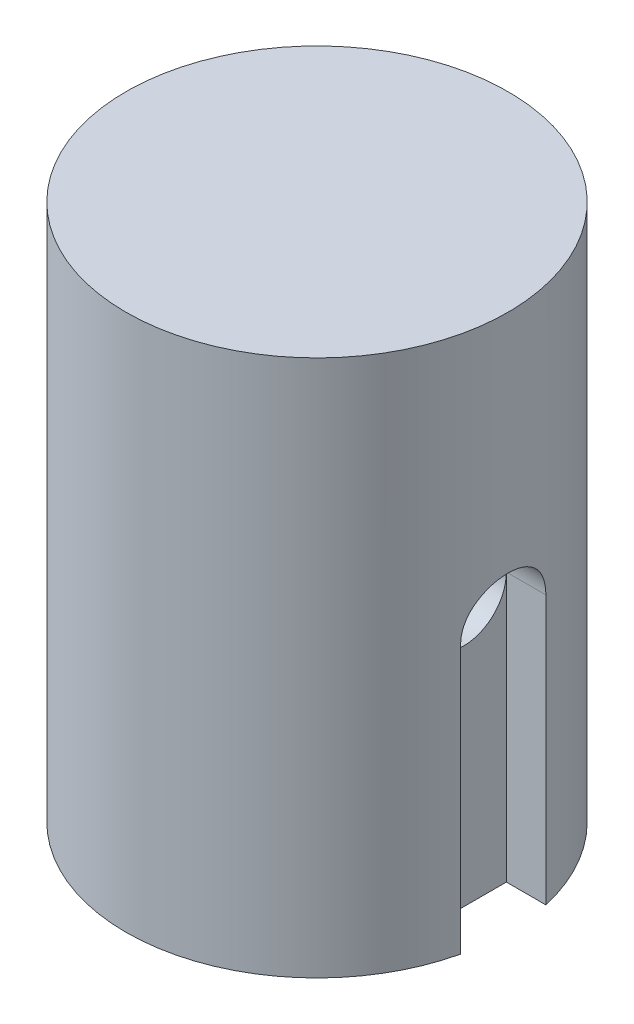
ISO-10303-21;
HEADER;
FILE_DESCRIPTION(('STEP AP214'),'2;1');
FILE_NAME('part.step','',(''),(''),'','','');
FILE_SCHEMA(('AUTOMOTIVE_DESIGN { 1 0 10303 214 1 1 1 1 }'));
ENDSEC;
DATA;
#1=APPLICATION_CONTEXT('core data for automotive mechanical design processes');
#2=APPLICATION_PROTOCOL_DEFINITION('international standard','automotive_design',2000,#1);
#3=PRODUCT_CONTEXT('',#1,'mechanical');
#4=PRODUCT('Part','Part','',(#3));
#5=PRODUCT_RELATED_PRODUCT_CATEGORY('part','',(#4));
#6=PRODUCT_DEFINITION_FORMATION('','',#4);
#7=PRODUCT_DEFINITION_CONTEXT('part definition',#1,'design');
#8=PRODUCT_DEFINITION('design','',#6,#7);
#9=PRODUCT_DEFINITION_SHAPE('','',#8);
#10=(LENGTH_UNIT() NAMED_UNIT(*) SI_UNIT(.MILLI.,.METRE.));
#11=(NAMED_UNIT(*) PLANE_ANGLE_UNIT() SI_UNIT($,.RADIAN.));
#12=(NAMED_UNIT(*) SI_UNIT($,.STERADIAN.) SOLID_ANGLE_UNIT());
#13=UNCERTAINTY_MEASURE_WITH_UNIT(LENGTH_MEASURE(1.E-05),#10,'distance_accuracy_value','');
#14=(GEOMETRIC_REPRESENTATION_CONTEXT(3) GLOBAL_UNCERTAINTY_ASSIGNED_CONTEXT((#13)) GLOBAL_UNIT_ASSIGNED_CONTEXT((#10,
#11,#12)) REPRESENTATION_CONTEXT('',''));
#15=CARTESIAN_POINT('',(0.,0.,0.));
#16=DIRECTION('',(0.,0.,1.));
#17=DIRECTION('',(1.,0.,0.));
#18=AXIS2_PLACEMENT_3D('',#15,#16,#17);
#19=CARTESIAN_POINT('',(0.,-25.,0.));
#20=DIRECTION('',(0.,1.,0.));
#21=DIRECTION('',(0.,0.,1.));
#22=AXIS2_PLACEMENT_3D('',#19,#20,#21);
#23=CYLINDRICAL_SURFACE('',#22,8.895);
#24=DIRECTION('',(0.,-1.,0.));
#25=VECTOR('',#24,1.);
#26=CARTESIAN_POINT('',(-8.67082930632215,-12.5,-1.98437499999999));
#27=LINE('',#26,#25);
#28=CARTESIAN_POINT('',(-8.67082930632215,-12.5,-1.984375));
#29=VERTEX_POINT('',#28);
#30=CARTESIAN_POINT('',(-8.67082930632215,-25.,-1.98437499999999));
#31=VERTEX_POINT('',#30);
#32=EDGE_CURVE('E146',#29,#31,#27,.T.);
#33=ORIENTED_EDGE('',*,*,#32,.F.);
#34=CARTESIAN_POINT('',(-8.895,-10.515625,0.));
#35=CARTESIAN_POINT('',(-8.89499798053136,-10.5156286782961,-0.110003108531044));
#36=CARTESIAN_POINT('',(-8.89293872905295,-10.5248028437771,-0.220050190385659));
#37=CARTESIAN_POINT('',(-8.88492294410009,-10.5612168017032,-0.437014773196951));
#38=CARTESIAN_POINT('',(-8.87896370197709,-10.5884691501126,-0.543930045069365));
#39=CARTESIAN_POINT('',(-8.86381097564101,-10.66014046251,-0.751464389222808));
#40=CARTESIAN_POINT('',(-8.85462093856362,-10.7045411348459,-0.852090038043748));
#41=CARTESIAN_POINT('',(-8.83399673910637,-10.809189812261,-1.04446068714721));
#42=CARTESIAN_POINT('',(-8.82256261666939,-10.8694375352822,-1.13620584545178));
#43=CARTESIAN_POINT('',(-8.79848845487047,-11.0051316026497,-1.30974205494041));
#44=CARTESIAN_POINT('',(-8.78583296110134,-11.0807914141361,-1.39136405863448));
#45=CARTESIAN_POINT('',(-8.76085045969245,-11.2447038420026,-1.54087074401027));
#46=CARTESIAN_POINT('',(-8.74852348238285,-11.332957616368,-1.60875416107165));
#47=CARTESIAN_POINT('',(-8.72544092397066,-11.520810939859,-1.72960902031442));
#48=CARTESIAN_POINT('',(-8.71470512331446,-11.6205296910602,-1.78239929438126));
#49=CARTESIAN_POINT('',(-8.69624278881732,-11.8277023668504,-1.87040686218199));
#50=CARTESIAN_POINT('',(-8.68851587956583,-11.9351553244818,-1.90562634832583));
#51=CARTESIAN_POINT('',(-8.67710379688232,-12.1529089981679,-1.95693151039241));
#52=CARTESIAN_POINT('',(-8.67335534128796,-12.2631356576469,-1.9733171227466));
#53=CARTESIAN_POINT('',(-8.67013460913494,-12.4848322544565,-1.98742225140913));
#54=CARTESIAN_POINT('',(-8.67066178498573,-12.5963020307519,-1.98514415802333));
#55=CARTESIAN_POINT('',(-8.6758755128654,-12.8150819521088,-1.96222763913715));
#56=CARTESIAN_POINT('',(-8.68048286491296,-12.9224308899092,-1.94193880078754));
#57=CARTESIAN_POINT('',(-8.69321246305035,-13.1321618701326,-1.88413107223078));
#58=CARTESIAN_POINT('',(-8.70133491344556,-13.2345436234669,-1.84661118050843));
#59=CARTESIAN_POINT('',(-8.72025684575896,-13.4324107413625,-1.75508849250558));
#60=CARTESIAN_POINT('',(-8.73107785800529,-13.5278322502844,-1.70095228060515));
#61=CARTESIAN_POINT('',(-8.75416459631689,-13.7083654708171,-1.57782741855743));
#62=CARTESIAN_POINT('',(-8.76643052669428,-13.7934757209513,-1.50883666682662));
#63=CARTESIAN_POINT('',(-8.79136402902234,-13.9529819654673,-1.35611581093398));
#64=CARTESIAN_POINT('',(-8.8040344247618,-14.0270934621295,-1.27208872607875));
#65=CARTESIAN_POINT('',(-8.82809796612522,-14.1602203300518,-1.09265382918496));
#66=CARTESIAN_POINT('',(-8.83949108676558,-14.2192354060537,-0.99724579460952));
#67=CARTESIAN_POINT('',(-8.85975573704167,-14.3205689320845,-0.797402322384055));
#68=CARTESIAN_POINT('',(-8.86862144653922,-14.3628489299928,-0.692946759215006));
#69=CARTESIAN_POINT('',(-8.88278925247284,-14.4291766978656,-0.478171595830713));
#70=CARTESIAN_POINT('',(-8.88809188846723,-14.4532272283998,-0.367852886206666));
#71=CARTESIAN_POINT('',(-8.89445888054048,-14.4819968395156,-0.146922244637292));
#72=CARTESIAN_POINT('',(-8.89560839126927,-14.487104381303,-0.0363632839080309));
#73=CARTESIAN_POINT('',(-8.89377875578923,-14.4788975892449,0.184028216567811));
#74=CARTESIAN_POINT('',(-8.8907999015053,-14.4655845579548,0.293860807125686));
#75=CARTESIAN_POINT('',(-8.88110209755264,-14.4212364374193,0.508386435136476));
#76=CARTESIAN_POINT('',(-8.87442639805636,-14.3904061793644,0.613123945630332));
#77=CARTESIAN_POINT('',(-8.85808259752387,-14.3121269856043,0.815940337496674));
#78=CARTESIAN_POINT('',(-8.84841423460527,-14.2646765954544,0.914018635217614));
#79=CARTESIAN_POINT('',(-8.82694819211914,-14.1537022358176,1.10233086452755));
#80=CARTESIAN_POINT('',(-8.81512120261388,-14.0899514567944,1.1924277186746));
#81=CARTESIAN_POINT('',(-8.79070766484064,-13.9484834474263,1.36078396392382));
#82=CARTESIAN_POINT('',(-8.77812101382286,-13.8707643249358,1.43904174866253));
#83=CARTESIAN_POINT('',(-8.75331093693519,-13.7017800928848,1.58304298834678));
#84=CARTESIAN_POINT('',(-8.74109914583823,-13.6102832900571,1.64851693602485));
#85=CARTESIAN_POINT('',(-8.71869698047453,-13.4173649355546,1.76317168339184));
#86=CARTESIAN_POINT('',(-8.70850651768816,-13.315943818784,1.81235319663538));
#87=CARTESIAN_POINT('',(-8.69140054463049,-13.1066041991113,1.89268852324433));
#88=CARTESIAN_POINT('',(-8.68446640876592,-12.9987267288714,1.92394509722755));
#89=CARTESIAN_POINT('',(-8.67462629679212,-12.7790753551192,1.96784118701104));
#90=CARTESIAN_POINT('',(-8.67171964652347,-12.6673021069317,1.98048381861487));
#91=CARTESIAN_POINT('',(-8.67030729710035,-12.4457524437848,1.9866564116767));
#92=CARTESIAN_POINT('',(-8.67170310734381,-12.3359883589578,1.98061409297813));
#93=CARTESIAN_POINT('',(-8.67851500496339,-12.1190849742809,1.95054750257742));
#94=CARTESIAN_POINT('',(-8.68393104095299,-12.0119456408994,1.92652346071756));
#95=CARTESIAN_POINT('',(-8.6981241844418,-11.8036893505729,1.86138575645093));
#96=CARTESIAN_POINT('',(-8.70688857054173,-11.7025512531436,1.82033672721598));
#97=CARTESIAN_POINT('',(-8.72679539432478,-11.5085347915276,1.72236893705458));
#98=CARTESIAN_POINT('',(-8.73793809113817,-11.4156573289467,1.66544844663638));
#99=CARTESIAN_POINT('',(-8.76163848646004,-11.238695474782,1.53594515186167));
#100=CARTESIAN_POINT('',(-8.77422098481682,-11.154836679788,1.46305855847869));
#101=CARTESIAN_POINT('',(-8.79921922589108,-11.0004001651611,1.30430465490752));
#102=CARTESIAN_POINT('',(-8.81163492929224,-10.9298255275292,1.21843434073407));
#103=CARTESIAN_POINT('',(-8.83510136371243,-10.8030382120514,1.03474108869537));
#104=CARTESIAN_POINT('',(-8.84613120897754,-10.7470341562857,0.936771332481138));
#105=CARTESIAN_POINT('',(-8.86537241774909,-10.6523773860926,0.732581640881906));
#106=CARTESIAN_POINT('',(-8.87358609932992,-10.6137103928671,0.626368579579056));
#107=CARTESIAN_POINT('',(-8.88483654653533,-10.5615673365609,0.43340420838887));
#108=CARTESIAN_POINT('',(-8.88862390497389,-10.5443723842688,0.347682052709739));
#109=CARTESIAN_POINT('',(-8.8937063738634,-10.5214000285145,0.174649120553264));
#110=CARTESIAN_POINT('',(-8.89500160338379,-10.5156220795683,0.0873384201749424));
#111=CARTESIAN_POINT('',(-8.895,-10.515625,0.));
#112=B_SPLINE_CURVE_WITH_KNOTS('',3,(#34,#35,#36,#37,#38,#39,#40,#41,#42,#43,#44,#45,#46,#47,
#48,#49,#50,#51,#52,#53,#54,#55,#56,#57,#58,#59,#60,#61,#62,#63,#64,#65,#66,#67,#68,#69,#70,#71,
#72,#73,#74,#75,#76,#77,#78,#79,#80,#81,#82,#83,#84,#85,#86,#87,#88,#89,#90,#91,#92,#93,#94,#95,
#96,#97,#98,#99,#100,#101,#102,#103,#104,#105,#106,#107,#108,#109,#110,#111),.UNSPECIFIED.,.T.,
.F.,(4,2,2,2,2,2,2,2,2,2,2,2,2,2,2,2,2,2,2,2,2,2,2,2,2,2,2,2,2,2,2,2,2,2,2,2,2,2,4),(0.,
0.32968958471569,0.659608391077071,0.989176249620352,1.31873824265806,1.65322013476703,
1.98773280154188,2.32610663322488,2.6644382334597,2.99730368340978,3.33012650314447,
3.65662716066737,3.98314679768962,4.31235992028412,4.64161964977686,4.97829541698964,
5.31497776845579,5.65242928429447,5.98982968812842,6.32027155964406,6.65069006614927,
6.9773221968005,7.30398291850589,7.63546294699817,7.96698791151875,8.30488633992517,
8.64276996754305,8.97869668766252,9.31456717032856,9.64280656540119,9.97104176499135,
10.2980421054524,10.6250780926347,10.9589814011184,11.2929620818613,11.631489944489,
11.9697384812382,12.2315123866697,12.493273784704),.UNSPECIFIED.);
#113=CARTESIAN_POINT('',(-8.67082930632215,-12.5,1.984375));
#114=VERTEX_POINT('',#113);
#115=EDGE_CURVE('E174',#114,#29,#112,.T.);
#116=ORIENTED_EDGE('',*,*,#115,.F.);
#117=DIRECTION('',(0.,-1.,0.));
#118=VECTOR('',#117,1.);
#119=CARTESIAN_POINT('',(-8.67082930632215,-12.5,1.984375));
#120=LINE('',#119,#118);
#121=CARTESIAN_POINT('',(-8.67082930632215,-25.,1.984375));
#122=VERTEX_POINT('',#121);
#123=EDGE_CURVE('E148',#114,#122,#120,.T.);
#124=ORIENTED_EDGE('',*,*,#123,.T.);
#125=CARTESIAN_POINT('',(0.,-25.,0.));
#126=DIRECTION('',(0.,1.,0.));
#127=DIRECTION('',(0.,0.,1.));
#128=AXIS2_PLACEMENT_3D('',#125,#126,#127);
#129=CIRCLE('',#128,8.895);
#130=CARTESIAN_POINT('',(8.67082930632215,-25.,1.984375));
#131=VERTEX_POINT('',#130);
#132=EDGE_CURVE('E11',#122,#131,#129,.T.);
#133=ORIENTED_EDGE('',*,*,#132,.T.);
#134=DIRECTION('',(0.,-1.,0.));
#135=VECTOR('',#134,1.);
#136=CARTESIAN_POINT('',(8.67082930632215,-12.5,1.984375));
#137=LINE('',#136,#135);
#138=CARTESIAN_POINT('',(8.67082930632215,-12.5,1.984375));
#139=VERTEX_POINT('',#138);
#140=EDGE_CURVE('E55',#139,#131,#137,.T.);
#141=ORIENTED_EDGE('',*,*,#140,.F.);
#142=CARTESIAN_POINT('',(8.67082930632215,-12.5,-1.984375));
#143=CARTESIAN_POINT('',(8.67083152693427,-12.3900352924012,-1.98437129476868));
#144=CARTESIAN_POINT('',(8.67294398159313,-12.2800265459929,-1.97520331559507));
#145=CARTESIAN_POINT('',(8.68114924080244,-12.0631415333078,-1.9388161542682));
#146=CARTESIAN_POINT('',(8.687244848201,-11.956267528248,-1.91158426077147));
#147=CARTESIAN_POINT('',(8.70269247518692,-11.748820633369,-1.83997273746253));
#148=CARTESIAN_POINT('',(8.71204083806803,-11.6482408168817,-1.79561235715901));
#149=CARTESIAN_POINT('',(8.73293623267991,-11.4559475998378,-1.69105869172377));
#150=CARTESIAN_POINT('',(8.74448323779282,-11.3642340919615,-1.63086559826731));
#151=CARTESIAN_POINT('',(8.76870152698746,-11.190664815864,-1.49522783567887));
#152=CARTESIAN_POINT('',(8.78138768085908,-11.1089875068265,-1.41955741552215));
#153=CARTESIAN_POINT('',(8.80632483899608,-10.959373320034,-1.25560020996667));
#154=CARTESIAN_POINT('',(8.81857580851969,-10.8914375372732,-1.16731242010812));
#155=CARTESIAN_POINT('',(8.8414245341093,-10.7705257147047,-0.979426653986215));
#156=CARTESIAN_POINT('',(8.85200269761223,-10.7177218091067,-0.879715314874414));
#157=CARTESIAN_POINT('',(8.87014575131516,-10.6296870280497,-0.672558617309702));
#158=CARTESIAN_POINT('',(8.8777109934971,-10.5944540997552,-0.56511416400382));
#159=CARTESIAN_POINT('',(8.88887072235122,-10.5431240620808,-0.347397468059264));
#160=CARTESIAN_POINT('',(8.89252784470798,-10.5267247747917,-0.237199733411299));
#161=CARTESIAN_POINT('',(8.89567645545256,-10.5125822573189,-0.0155605825450066));
#162=CARTESIAN_POINT('',(8.89516843879117,-10.5148368104668,0.0958806843305372));
#163=CARTESIAN_POINT('',(8.89009171695082,-10.5377139363359,0.31475870560092));
#164=CARTESIAN_POINT('',(8.88559503342556,-10.5580107416537,0.422231426260748));
#165=CARTESIAN_POINT('',(8.8731285194068,-10.6158765069307,0.63220575827785));
#166=CARTESIAN_POINT('',(8.86515852778899,-10.6534462681744,0.734707138772998));
#167=CARTESIAN_POINT('',(8.84652583210922,-10.7450763392216,0.932727372605715));
#168=CARTESIAN_POINT('',(8.83584323372576,-10.7992591265551,1.02818760316908));
#169=CARTESIAN_POINT('',(8.81295504188348,-10.9224856773742,1.2087789663073));
#170=CARTESIAN_POINT('',(8.80074923327929,-10.9915315411911,1.29390863638836));
#171=CARTESIAN_POINT('',(8.77584357058241,-11.1442943709138,1.45336071135604));
#172=CARTESIAN_POINT('',(8.76313874101006,-11.2282964215203,1.5274094616731));
#173=CARTESIAN_POINT('',(8.73891357366072,-11.4076579397835,1.66042127107666));
#174=CARTESIAN_POINT('',(8.72739327066983,-11.5030177408069,1.71938388720298));
#175=CARTESIAN_POINT('',(8.70682769295961,-11.7028425850512,1.82067818880462));
#176=CARTESIAN_POINT('',(8.69779041740815,-11.8073356589106,1.86295631105176));
#177=CARTESIAN_POINT('',(8.68332365321309,-12.022193123648,1.92926911648296));
#178=CARTESIAN_POINT('',(8.67789356668125,-12.1325565382453,1.95330682309304));
#179=CARTESIAN_POINT('',(8.67137842965835,-12.3535164219845,1.98202813124953));
#180=CARTESIAN_POINT('',(8.6702037566994,-12.4640584104577,1.98711100551234));
#181=CARTESIAN_POINT('',(8.67209039478514,-12.6844102825169,1.97886095731595));
#182=CARTESIAN_POINT('',(8.67515140212929,-12.7942202180243,1.96552935518464));
#183=CARTESIAN_POINT('',(8.68507970183092,-13.008588609668,1.92117571919051));
#184=CARTESIAN_POINT('',(8.69189929584423,-13.1131953191398,1.8903752346446));
#185=CARTESIAN_POINT('',(8.70853304572482,-13.3157631209793,1.81219878075513));
#186=CARTESIAN_POINT('',(8.71834749764175,-13.4137235551742,1.76482117265091));
#187=CARTESIAN_POINT('',(8.74006093984554,-13.6019411777236,1.65396154223488));
#188=CARTESIAN_POINT('',(8.75199070504297,-13.6920504352035,1.59023451518154));
#189=CARTESIAN_POINT('',(8.7765101984565,-13.8604425592094,1.4488041612309));
#190=CARTESIAN_POINT('',(8.78910001194908,-13.9387238925018,1.37109902523044));
#191=CARTESIAN_POINT('',(8.81381758079177,-14.0827966953209,1.20210799703321));
#192=CARTESIAN_POINT('',(8.82593157346983,-14.14831541272,1.11058721230565));
#193=CARTESIAN_POINT('',(8.84807556919855,-14.2630486894093,0.91760694147292));
#194=CARTESIAN_POINT('',(8.85810567158719,-14.3122640259399,0.816147929457443));
#195=CARTESIAN_POINT('',(8.87489393112164,-14.3926180815481,0.606815775294063));
#196=CARTESIAN_POINT('',(8.88167322724541,-14.423873857297,0.498989339167028));
#197=CARTESIAN_POINT('',(8.89128759699143,-14.4677855598397,0.279447263775833));
#198=CARTESIAN_POINT('',(8.89412326837703,-14.4804443055345,0.167732216568148));
#199=CARTESIAN_POINT('',(8.89551225388667,-14.4866716096712,-0.0538303410463871));
#200=CARTESIAN_POINT('',(8.89415677257247,-14.4806467378316,-0.1636660480899));
#201=CARTESIAN_POINT('',(8.88751206547856,-14.4505901194767,-0.380717396055891));
#202=CARTESIAN_POINT('',(8.88222291602629,-14.4265587223531,-0.487933087774485));
#203=CARTESIAN_POINT('',(8.86831291596493,-14.3613693329617,-0.696371660604404));
#204=CARTESIAN_POINT('',(8.85970370424092,-14.3202711322204,-0.797614067913526));
#205=CARTESIAN_POINT('',(8.84007111469181,-14.2221722616271,-0.991819184416284));
#206=CARTESIAN_POINT('',(8.82904749249992,-14.1651699819348,-1.08478105418124));
#207=CARTESIAN_POINT('',(8.80551621508588,-14.0355666300762,-1.26176241652204));
#208=CARTESIAN_POINT('',(8.79298364506869,-13.9626809241806,-1.34557017665365));
#209=CARTESIAN_POINT('',(8.76797805507896,-13.8039510336438,-1.49990415519922));
#210=CARTESIAN_POINT('',(8.7555050502752,-13.7181037126502,-1.57042714975871));
#211=CARTESIAN_POINT('',(8.73183513193552,-13.5344380779377,-1.69714603015807));
#212=CARTESIAN_POINT('',(8.72065858524308,-13.4364686619124,-1.75312694377475));
#213=CARTESIAN_POINT('',(8.7011051990314,-13.2322823615859,-1.84774053682795));
#214=CARTESIAN_POINT('',(8.69272603418347,-13.126072418212,-1.88638763425605));
#215=CARTESIAN_POINT('',(8.68123438698859,-12.9331580464439,-1.93848519859973));
#216=CARTESIAN_POINT('',(8.67735881646133,-12.847485490319,-1.95566030472962));
#217=CARTESIAN_POINT('',(8.67215546197685,-12.6745511498479,-1.97860637521381));
#218=CARTESIAN_POINT('',(8.67082754361105,-12.5872894495867,-1.98437794119458));
#219=CARTESIAN_POINT('',(8.67082930632215,-12.5,-1.984375));
#220=B_SPLINE_CURVE_WITH_KNOTS('',3,(#142,#143,#144,#145,#146,#147,#148,#149,#150,#151,#152,
#153,#154,#155,#156,#157,#158,#159,#160,#161,#162,#163,#164,#165,#166,#167,#168,#169,#170,#171,
#172,#173,#174,#175,#176,#177,#178,#179,#180,#181,#182,#183,#184,#185,#186,#187,#188,#189,#190,
#191,#192,#193,#194,#195,#196,#197,#198,#199,#200,#201,#202,#203,#204,#205,#206,#207,#208,#209,
#210,#211,#212,#213,#214,#215,#216,#217,#218,#219),.UNSPECIFIED.,.T.,.F.,(4,2,2,2,2,2,2,2,2,2,2,
2,2,2,2,2,2,2,2,2,2,2,2,2,2,2,2,2,2,2,2,2,2,2,2,2,2,2,4),(0.,0.329574133527324,
0.659380430494616,0.988817154975628,1.31824989138673,1.6528827972829,1.98754235792109,
2.32587008991828,2.66415828546683,2.99693943397993,3.32968103809655,3.65653406946799,
3.98340226493483,4.31274068542326,4.6421256759768,4.97863673959058,5.31515768273329,
5.65275035769749,5.99028706301795,6.32067223910689,6.65103372763026,6.97729620213301,
7.30359093900236,7.63509437723089,7.96664075087856,8.30464018838773,8.64262350993627,
8.97837818149084,9.31408195476448,9.64253221398148,9.97097610023751,10.2982789020109,
10.6256148460068,10.9593860612475,11.2932381697132,11.6317758832356,11.9700314818907,
12.2316596280387,12.4932739708748),.UNSPECIFIED.);
#221=CARTESIAN_POINT('',(8.67082930632215,-12.5,-1.984375));
#222=VERTEX_POINT('',#221);
#223=EDGE_CURVE('E113',#222,#139,#220,.T.);
#224=ORIENTED_EDGE('',*,*,#223,.F.);
#225=DIRECTION('',(0.,-1.,0.));
#226=VECTOR('',#225,1.);
#227=CARTESIAN_POINT('',(8.67082930632215,-12.5,-1.98437499999999));
#228=LINE('',#227,#226);
#229=CARTESIAN_POINT('',(8.67082930632215,-25.,-1.98437499999999));
#230=VERTEX_POINT('',#229);
#231=EDGE_CURVE('E115',#222,#230,#228,.T.);
#232=ORIENTED_EDGE('',*,*,#231,.T.);
#233=EDGE_CURVE('E48',#230,#31,#129,.T.);
#234=ORIENTED_EDGE('',*,*,#233,.T.);
#235=EDGE_LOOP('',(#33,#116,#124,#133,#141,#224,#232,#234));
#236=FACE_BOUND('',#235,.T.);
#237=CARTESIAN_POINT('',(0.,0.,0.));
#238=DIRECTION('',(0.,1.,0.));
#239=DIRECTION('',(0.,0.,1.));
#240=AXIS2_PLACEMENT_3D('',#237,#238,#239);
#241=CIRCLE('',#240,8.895);
#242=CARTESIAN_POINT('',(0.,0.,8.895));
#243=VERTEX_POINT('',#242);
#244=EDGE_CURVE('E43',#243,#243,#241,.T.);
#245=ORIENTED_EDGE('',*,*,#244,.F.);
#246=EDGE_LOOP('',(#245));
#247=FACE_BOUND('',#246,.T.);
#248=ADVANCED_FACE('F39',(#236,#247),#23,.T.);
#249=CARTESIAN_POINT('',(0.,-25.,0.));
#250=DIRECTION('',(0.,1.,0.));
#251=DIRECTION('',(0.,0.,1.));
#252=AXIS2_PLACEMENT_3D('',#249,#250,#251);
#253=PLANE('',#252);
#254=DIRECTION('',(-1.,0.,0.));
#255=VECTOR('',#254,1.);
#256=CARTESIAN_POINT('',(6.83125,-25.,-1.984375));
#257=LINE('',#256,#255);
#258=CARTESIAN_POINT('',(6.83125,-25.,-1.984375));
#259=VERTEX_POINT('',#258);
#260=EDGE_CURVE('E176',#230,#259,#257,.T.);
#261=ORIENTED_EDGE('',*,*,#260,.T.);
#262=DIRECTION('',(0.,0.,1.));
#263=VECTOR('',#262,1.);
#264=CARTESIAN_POINT('',(6.83125,-25.,1.984375));
#265=LINE('',#264,#263);
#266=CARTESIAN_POINT('',(6.83125,-25.,1.984375));
#267=VERTEX_POINT('',#266);
#268=EDGE_CURVE('E276',#259,#267,#265,.T.);
#269=ORIENTED_EDGE('',*,*,#268,.T.);
#270=DIRECTION('',(1.,0.,0.));
#271=VECTOR('',#270,1.);
#272=CARTESIAN_POINT('',(6.83125,-25.,1.984375));
#273=LINE('',#272,#271);
#274=EDGE_CURVE('E126',#267,#131,#273,.T.);
#275=ORIENTED_EDGE('',*,*,#274,.T.);
#276=ORIENTED_EDGE('',*,*,#132,.F.);
#277=DIRECTION('',(-1.,0.,0.));
#278=VECTOR('',#277,1.);
#279=CARTESIAN_POINT('',(-6.83125,-25.,1.984375));
#280=LINE('',#279,#278);
#281=CARTESIAN_POINT('',(-6.83125,-25.,1.984375));
#282=VERTEX_POINT('',#281);
#283=EDGE_CURVE('E138',#282,#122,#280,.T.);
#284=ORIENTED_EDGE('',*,*,#283,.F.);
#285=DIRECTION('',(0.,0.,1.));
#286=VECTOR('',#285,1.);
#287=CARTESIAN_POINT('',(-6.83125,-25.,1.984375));
#288=LINE('',#287,#286);
#289=CARTESIAN_POINT('',(-6.83125,-25.,-1.984375));
#290=VERTEX_POINT('',#289);
#291=EDGE_CURVE('E142',#290,#282,#288,.T.);
#292=ORIENTED_EDGE('',*,*,#291,.F.);
#293=DIRECTION('',(1.,0.,0.));
#294=VECTOR('',#293,1.);
#295=CARTESIAN_POINT('',(-6.83125,-25.,-1.984375));
#296=LINE('',#295,#294);
#297=EDGE_CURVE('E63',#31,#290,#296,.T.);
#298=ORIENTED_EDGE('',*,*,#297,.F.);
#299=ORIENTED_EDGE('',*,*,#233,.F.);
#300=EDGE_LOOP('',(#261,#269,#275,#276,#284,#292,#298,#299));
#301=FACE_BOUND('',#300,.T.);
#302=ADVANCED_FACE('F163',(#301),#253,.F.);
#303=CARTESIAN_POINT('',(0.,0.,0.));
#304=DIRECTION('',(0.,1.,0.));
#305=DIRECTION('',(0.,0.,1.));
#306=AXIS2_PLACEMENT_3D('',#303,#304,#305);
#307=PLANE('',#306);
#308=ORIENTED_EDGE('',*,*,#244,.T.);
#309=EDGE_LOOP('',(#308));
#310=FACE_BOUND('',#309,.T.);
#311=ADVANCED_FACE('F208',(#310),#307,.T.);
#312=CARTESIAN_POINT('',(-6.83125,-12.5,-1.984375));
#313=DIRECTION('',(0.,0.,-1.));
#314=DIRECTION('',(-1.,0.,0.));
#315=AXIS2_PLACEMENT_3D('',#312,#313,#314);
#316=PLANE('',#315);
#317=ORIENTED_EDGE('',*,*,#297,.T.);
#318=DIRECTION('',(0.,-1.,0.));
#319=VECTOR('',#318,1.);
#320=CARTESIAN_POINT('',(-6.83125,-12.5,-1.984375));
#321=LINE('',#320,#319);
#322=CARTESIAN_POINT('',(-6.83125,-12.5,-1.984375));
#323=VERTEX_POINT('',#322);
#324=EDGE_CURVE('E140',#323,#290,#321,.T.);
#325=ORIENTED_EDGE('',*,*,#324,.F.);
#326=DIRECTION('',(1.,0.,0.));
#327=VECTOR('',#326,1.);
#328=CARTESIAN_POINT('',(-6.83125,-12.5,-1.984375));
#329=LINE('',#328,#327);
#330=EDGE_CURVE('E135',#29,#323,#329,.T.);
#331=ORIENTED_EDGE('',*,*,#330,.F.);
#332=ORIENTED_EDGE('',*,*,#32,.T.);
#333=EDGE_LOOP('',(#317,#325,#331,#332));
#334=FACE_BOUND('',#333,.T.);
#335=ADVANCED_FACE('F203',(#334),#316,.F.);
#336=CARTESIAN_POINT('',(-6.83125,-12.5,1.984375));
#337=DIRECTION('',(0.,0.,1.));
#338=DIRECTION('',(1.,0.,0.));
#339=AXIS2_PLACEMENT_3D('',#336,#337,#338);
#340=PLANE('',#339);
#341=ORIENTED_EDGE('',*,*,#283,.T.);
#342=ORIENTED_EDGE('',*,*,#123,.F.);
#343=DIRECTION('',(-1.,0.,0.));
#344=VECTOR('',#343,1.);
#345=CARTESIAN_POINT('',(-6.83125,-12.5,1.984375));
#346=LINE('',#345,#344);
#347=CARTESIAN_POINT('',(-6.83125,-12.5,1.984375));
#348=VERTEX_POINT('',#347);
#349=EDGE_CURVE('E137',#348,#114,#346,.T.);
#350=ORIENTED_EDGE('',*,*,#349,.F.);
#351=DIRECTION('',(0.,-1.,0.));
#352=VECTOR('',#351,1.);
#353=CARTESIAN_POINT('',(-6.83125,-12.5,1.984375));
#354=LINE('',#353,#352);
#355=EDGE_CURVE('E151',#348,#282,#354,.T.);
#356=ORIENTED_EDGE('',*,*,#355,.T.);
#357=EDGE_LOOP('',(#341,#342,#350,#356));
#358=FACE_BOUND('',#357,.T.);
#359=ADVANCED_FACE('F168',(#358),#340,.F.);
#360=CARTESIAN_POINT('',(-6.83125,-12.5,1.984375));
#361=DIRECTION('',(1.,0.,0.));
#362=DIRECTION('',(0.,0.,-1.));
#363=AXIS2_PLACEMENT_3D('',#360,#361,#362);
#364=PLANE('',#363);
#365=ORIENTED_EDGE('',*,*,#355,.F.);
#366=CARTESIAN_POINT('',(-6.83125,-12.5,0.));
#367=DIRECTION('',(1.,0.,0.));
#368=DIRECTION('',(0.,0.,-1.));
#369=AXIS2_PLACEMENT_3D('',#366,#367,#368);
#370=CIRCLE('',#369,1.984375);
#371=EDGE_CURVE('E159',#348,#323,#370,.T.);
#372=ORIENTED_EDGE('',*,*,#371,.T.);
#373=ORIENTED_EDGE('',*,*,#324,.T.);
#374=ORIENTED_EDGE('',*,*,#291,.T.);
#375=EDGE_LOOP('',(#365,#372,#373,#374));
#376=FACE_BOUND('',#375,.T.);
#377=ADVANCED_FACE('F157',(#376),#364,.F.);
#378=CARTESIAN_POINT('',(6.83125,-12.5,-1.984375));
#379=DIRECTION('',(0.,0.,1.));
#380=DIRECTION('',(1.,0.,0.));
#381=AXIS2_PLACEMENT_3D('',#378,#379,#380);
#382=PLANE('',#381);
#383=ORIENTED_EDGE('',*,*,#260,.F.);
#384=ORIENTED_EDGE('',*,*,#231,.F.);
#385=DIRECTION('',(-1.,0.,0.));
#386=VECTOR('',#385,1.);
#387=CARTESIAN_POINT('',(6.83125,-12.5,-1.984375));
#388=LINE('',#387,#386);
#389=CARTESIAN_POINT('',(6.83125,-12.5,-1.984375));
#390=VERTEX_POINT('',#389);
#391=EDGE_CURVE('E116',#222,#390,#388,.T.);
#392=ORIENTED_EDGE('',*,*,#391,.T.);
#393=DIRECTION('',(0.,-1.,0.));
#394=VECTOR('',#393,1.);
#395=CARTESIAN_POINT('',(6.83125,-12.5,-1.984375));
#396=LINE('',#395,#394);
#397=EDGE_CURVE('E123',#390,#259,#396,.T.);
#398=ORIENTED_EDGE('',*,*,#397,.T.);
#399=EDGE_LOOP('',(#383,#384,#392,#398));
#400=FACE_BOUND('',#399,.T.);
#401=ADVANCED_FACE('F195',(#400),#382,.T.);
#402=CARTESIAN_POINT('',(6.83125,-12.5,1.984375));
#403=DIRECTION('',(1.,0.,0.));
#404=DIRECTION('',(0.,0.,-1.));
#405=AXIS2_PLACEMENT_3D('',#402,#403,#404);
#406=PLANE('',#405);
#407=CARTESIAN_POINT('',(6.83125,-12.5,0.));
#408=DIRECTION('',(1.,0.,0.));
#409=DIRECTION('',(0.,0.,-1.));
#410=AXIS2_PLACEMENT_3D('',#407,#408,#409);
#411=CIRCLE('',#410,1.984375);
#412=CARTESIAN_POINT('',(6.83125,-12.5,1.984375));
#413=VERTEX_POINT('',#412);
#414=EDGE_CURVE('E111',#413,#390,#411,.T.);
#415=ORIENTED_EDGE('',*,*,#414,.F.);
#416=DIRECTION('',(0.,-1.,0.));
#417=VECTOR('',#416,1.);
#418=CARTESIAN_POINT('',(6.83125,-12.5,1.984375));
#419=LINE('',#418,#417);
#420=EDGE_CURVE('E121',#413,#267,#419,.T.);
#421=ORIENTED_EDGE('',*,*,#420,.T.);
#422=ORIENTED_EDGE('',*,*,#268,.F.);
#423=ORIENTED_EDGE('',*,*,#397,.F.);
#424=EDGE_LOOP('',(#415,#421,#422,#423));
#425=FACE_BOUND('',#424,.T.);
#426=ADVANCED_FACE('F120',(#425),#406,.T.);
#427=CARTESIAN_POINT('',(6.83125,-12.5,1.984375));
#428=DIRECTION('',(0.,0.,-1.));
#429=DIRECTION('',(-1.,0.,0.));
#430=AXIS2_PLACEMENT_3D('',#427,#428,#429);
#431=PLANE('',#430);
#432=ORIENTED_EDGE('',*,*,#274,.F.);
#433=ORIENTED_EDGE('',*,*,#420,.F.);
#434=DIRECTION('',(1.,0.,0.));
#435=VECTOR('',#434,1.);
#436=CARTESIAN_POINT('',(6.83125,-12.5,1.984375));
#437=LINE('',#436,#435);
#438=EDGE_CURVE('E107',#413,#139,#437,.T.);
#439=ORIENTED_EDGE('',*,*,#438,.T.);
#440=ORIENTED_EDGE('',*,*,#140,.T.);
#441=EDGE_LOOP('',(#432,#433,#439,#440));
#442=FACE_BOUND('',#441,.T.);
#443=ADVANCED_FACE('F125',(#442),#431,.T.);
#444=CARTESIAN_POINT('',(-8.895,-12.5,0.));
#445=DIRECTION('',(1.,0.,0.));
#446=DIRECTION('',(0.,0.,-1.));
#447=AXIS2_PLACEMENT_3D('',#444,#445,#446);
#448=CYLINDRICAL_SURFACE('',#447,1.984375);
#449=ORIENTED_EDGE('',*,*,#115,.T.);
#450=ORIENTED_EDGE('',*,*,#330,.T.);
#451=ORIENTED_EDGE('',*,*,#371,.F.);
#452=ORIENTED_EDGE('',*,*,#349,.T.);
#453=EDGE_LOOP('',(#449,#450,#451,#452));
#454=FACE_BOUND('',#453,.T.);
#455=ORIENTED_EDGE('',*,*,#223,.T.);
#456=ORIENTED_EDGE('',*,*,#438,.F.);
#457=ORIENTED_EDGE('',*,*,#414,.T.);
#458=ORIENTED_EDGE('',*,*,#391,.F.);
#459=EDGE_LOOP('',(#455,#456,#457,#458));
#460=FACE_BOUND('',#459,.T.);
#461=ADVANCED_FACE('F109',(#454,#460),#448,.F.);
#462=CLOSED_SHELL('',(#248,#302,#311,#335,#359,#377,#401,#426,#443,#461));
#463=MANIFOLD_SOLID_BREP('B2',#462);
#464=ADVANCED_BREP_SHAPE_REPRESENTATION('',(#18,#463),#14);
#465=SHAPE_DEFINITION_REPRESENTATION(#9,#464);
ENDSEC;
END-ISO-10303-21;
